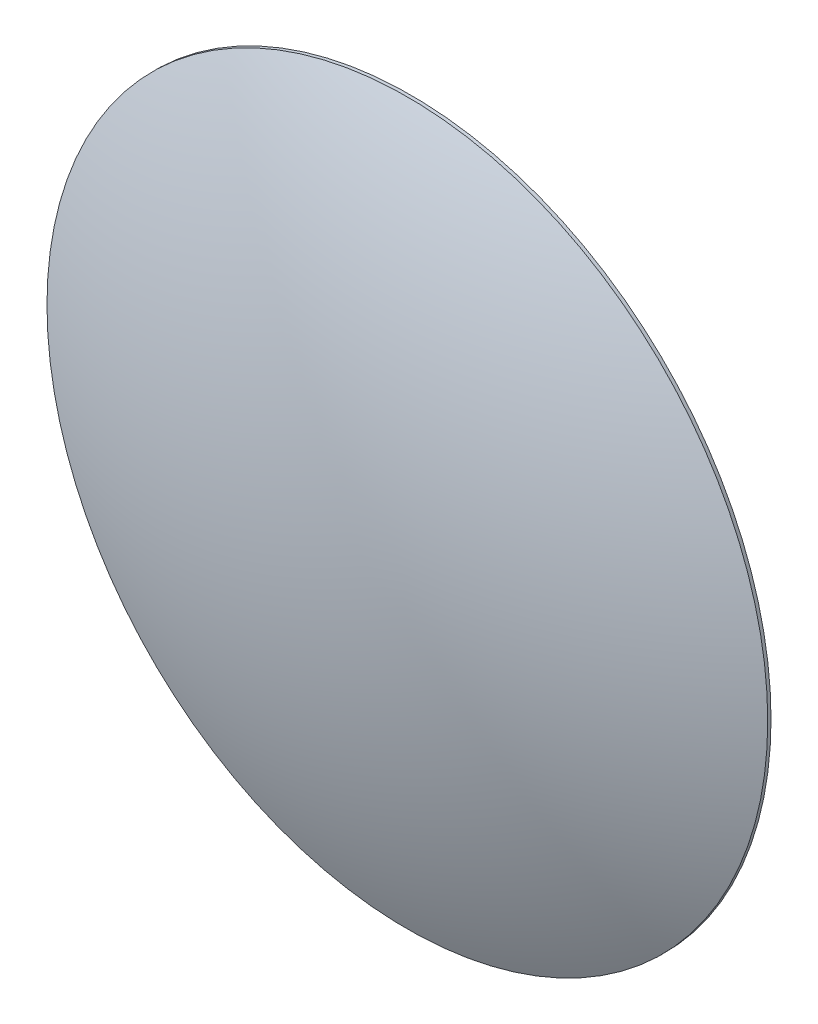
ISO-10303-21;
HEADER;
FILE_DESCRIPTION(('STEP AP214'),'2;1');
FILE_NAME('part.step','',(''),(''),'','','');
FILE_SCHEMA(('AUTOMOTIVE_DESIGN { 1 0 10303 214 1 1 1 1 }'));
ENDSEC;
DATA;
#1=APPLICATION_CONTEXT('core data for automotive mechanical design processes');
#2=APPLICATION_PROTOCOL_DEFINITION('international standard','automotive_design',2000,#1);
#3=PRODUCT_CONTEXT('',#1,'mechanical');
#4=PRODUCT('Part','Part','',(#3));
#5=PRODUCT_RELATED_PRODUCT_CATEGORY('part','',(#4));
#6=PRODUCT_DEFINITION_FORMATION('','',#4);
#7=PRODUCT_DEFINITION_CONTEXT('part definition',#1,'design');
#8=PRODUCT_DEFINITION('design','',#6,#7);
#9=PRODUCT_DEFINITION_SHAPE('','',#8);
#10=(LENGTH_UNIT() NAMED_UNIT(*) SI_UNIT(.MILLI.,.METRE.));
#11=(NAMED_UNIT(*) PLANE_ANGLE_UNIT() SI_UNIT($,.RADIAN.));
#12=(NAMED_UNIT(*) SI_UNIT($,.STERADIAN.) SOLID_ANGLE_UNIT());
#13=UNCERTAINTY_MEASURE_WITH_UNIT(LENGTH_MEASURE(1.E-05),#10,'distance_accuracy_value','');
#14=(GEOMETRIC_REPRESENTATION_CONTEXT(3) GLOBAL_UNCERTAINTY_ASSIGNED_CONTEXT((#13)) GLOBAL_UNIT_ASSIGNED_CONTEXT((#10,
#11,#12)) REPRESENTATION_CONTEXT('',''));
#15=CARTESIAN_POINT('',(0.,0.,0.));
#16=DIRECTION('',(0.,0.,1.));
#17=DIRECTION('',(1.,0.,0.));
#18=AXIS2_PLACEMENT_3D('',#15,#16,#17);
#19=CARTESIAN_POINT('',(0.,0.,0.1));
#20=DIRECTION('',(0.,0.,-1.));
#21=DIRECTION('',(-1.,0.,0.));
#22=AXIS2_PLACEMENT_3D('',#19,#20,#21);
#23=CYLINDRICAL_SURFACE('',#22,11.);
#24=CARTESIAN_POINT('',(0.,0.,0.1));
#25=DIRECTION('',(0.,0.,1.));
#26=DIRECTION('',(1.,0.,0.));
#27=AXIS2_PLACEMENT_3D('',#24,#25,#26);
#28=CIRCLE('',#27,11.);
#29=CARTESIAN_POINT('',(11.,0.,0.1));
#30=VERTEX_POINT('',#29);
#31=EDGE_CURVE('E10',#30,#30,#28,.T.);
#32=ORIENTED_EDGE('',*,*,#31,.F.);
#33=EDGE_LOOP('',(#32));
#34=FACE_BOUND('',#33,.T.);
#35=CARTESIAN_POINT('',(0.,0.,0.));
#36=DIRECTION('',(0.,0.,1.));
#37=DIRECTION('',(1.,0.,0.));
#38=AXIS2_PLACEMENT_3D('',#35,#36,#37);
#39=CIRCLE('',#38,11.);
#40=CARTESIAN_POINT('',(11.,0.,0.));
#41=VERTEX_POINT('',#40);
#42=EDGE_CURVE('E42',#41,#41,#39,.T.);
#43=ORIENTED_EDGE('',*,*,#42,.T.);
#44=EDGE_LOOP('',(#43));
#45=FACE_BOUND('',#44,.T.);
#46=ADVANCED_FACE('F34',(#34,#45),#23,.T.);
#47=CARTESIAN_POINT('',(0.,0.,-23.9083333333333));
#48=DIRECTION('',(0.,0.,1.));
#49=DIRECTION('',(1.,0.,0.));
#50=AXIS2_PLACEMENT_3D('',#47,#48,#49);
#51=SPHERICAL_SURFACE('',#50,26.4083333333333);
#52=ORIENTED_EDGE('',*,*,#31,.T.);
#53=EDGE_LOOP('',(#52));
#54=FACE_BOUND('',#53,.T.);
#55=ADVANCED_FACE('F36',(#54),#51,.T.);
#56=CARTESIAN_POINT('',(0.,0.,0.));
#57=DIRECTION('',(0.,0.,1.));
#58=DIRECTION('',(1.,0.,0.));
#59=AXIS2_PLACEMENT_3D('',#56,#57,#58);
#60=PLANE('',#59);
#61=ORIENTED_EDGE('',*,*,#42,.F.);
#62=EDGE_LOOP('',(#61));
#63=FACE_BOUND('',#62,.T.);
#64=ADVANCED_FACE('F52',(#63),#60,.F.);
#65=CLOSED_SHELL('',(#46,#55,#64));
#66=MANIFOLD_SOLID_BREP('B2',#65);
#67=ADVANCED_BREP_SHAPE_REPRESENTATION('',(#18,#66),#14);
#68=SHAPE_DEFINITION_REPRESENTATION(#9,#67);
ENDSEC;
END-ISO-10303-21;
